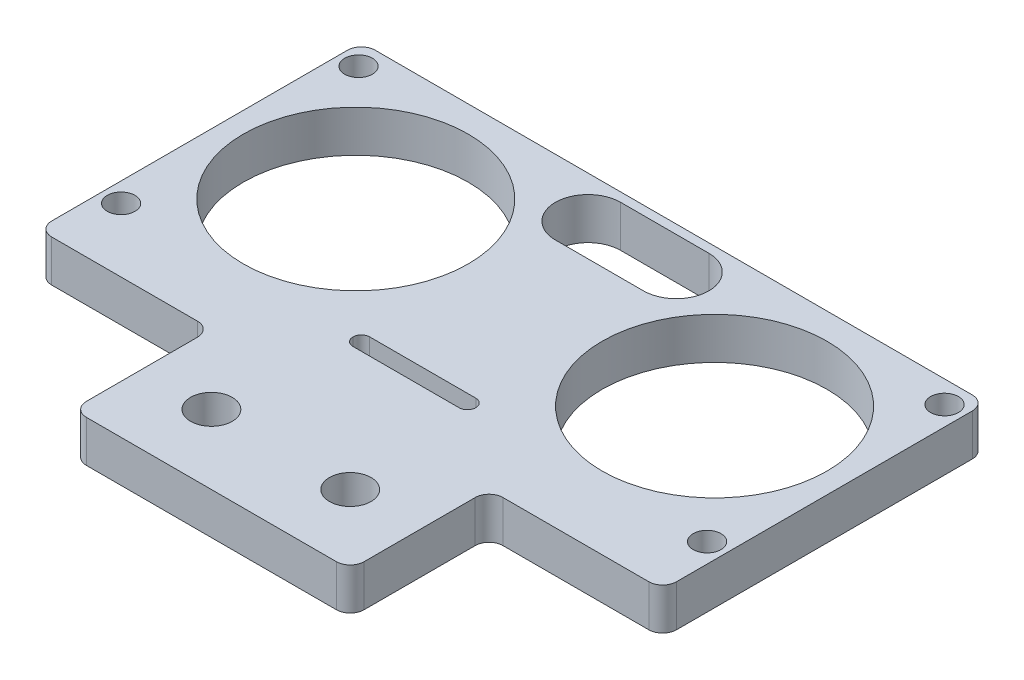
ISO-10303-21;
HEADER;
FILE_DESCRIPTION(('STEP AP214'),'2;1');
FILE_NAME('part.step','',(''),(''),'','','');
FILE_SCHEMA(('AUTOMOTIVE_DESIGN { 1 0 10303 214 1 1 1 1 }'));
ENDSEC;
DATA;
#1=APPLICATION_CONTEXT('core data for automotive mechanical design processes');
#2=APPLICATION_PROTOCOL_DEFINITION('international standard','automotive_design',2000,#1);
#3=PRODUCT_CONTEXT('',#1,'mechanical');
#4=PRODUCT('Part','Part','',(#3));
#5=PRODUCT_RELATED_PRODUCT_CATEGORY('part','',(#4));
#6=PRODUCT_DEFINITION_FORMATION('','',#4);
#7=PRODUCT_DEFINITION_CONTEXT('part definition',#1,'design');
#8=PRODUCT_DEFINITION('design','',#6,#7);
#9=PRODUCT_DEFINITION_SHAPE('','',#8);
#10=(LENGTH_UNIT() NAMED_UNIT(*) SI_UNIT(.MILLI.,.METRE.));
#11=(NAMED_UNIT(*) PLANE_ANGLE_UNIT() SI_UNIT($,.RADIAN.));
#12=(NAMED_UNIT(*) SI_UNIT($,.STERADIAN.) SOLID_ANGLE_UNIT());
#13=UNCERTAINTY_MEASURE_WITH_UNIT(LENGTH_MEASURE(1.E-05),#10,'distance_accuracy_value','');
#14=(GEOMETRIC_REPRESENTATION_CONTEXT(3) GLOBAL_UNCERTAINTY_ASSIGNED_CONTEXT((#13)) GLOBAL_UNIT_ASSIGNED_CONTEXT((#10,
#11,#12)) REPRESENTATION_CONTEXT('',''));
#15=CARTESIAN_POINT('',(0.,0.,0.));
#16=DIRECTION('',(0.,0.,1.));
#17=DIRECTION('',(1.,0.,0.));
#18=AXIS2_PLACEMENT_3D('',#15,#16,#17);
#19=CARTESIAN_POINT('',(0.,3.,0.));
#20=DIRECTION('',(0.,-1.,0.));
#21=DIRECTION('',(0.,0.,-1.));
#22=AXIS2_PLACEMENT_3D('',#19,#20,#21);
#23=PLANE('',#22);
#24=CARTESIAN_POINT('',(18.68,3.,-1.61999999999999));
#25=DIRECTION('',(0.,-1.,0.));
#26=DIRECTION('',(0.,0.,-1.));
#27=AXIS2_PLACEMENT_3D('',#24,#25,#26);
#28=CIRCLE('',#27,0.6);
#29=CARTESIAN_POINT('',(18.68,3.,-1.01999999999999));
#30=VERTEX_POINT('',#29);
#31=CARTESIAN_POINT('',(18.08,3.,-1.61999999999999));
#32=VERTEX_POINT('',#31);
#33=EDGE_CURVE('E59',#30,#32,#28,.T.);
#34=ORIENTED_EDGE('',*,*,#33,.T.);
#35=CARTESIAN_POINT('',(18.68,3.,-1.61999999999999));
#36=DIRECTION('',(0.,-1.,0.));
#37=DIRECTION('',(0.,0.,-1.));
#38=AXIS2_PLACEMENT_3D('',#35,#36,#37);
#39=CIRCLE('',#38,0.6);
#40=CARTESIAN_POINT('',(18.68,3.,-2.21999999999999));
#41=VERTEX_POINT('',#40);
#42=EDGE_CURVE('E45',#32,#41,#39,.T.);
#43=ORIENTED_EDGE('',*,*,#42,.T.);
#44=DIRECTION('',(-1.,0.,0.));
#45=VECTOR('',#44,1.);
#46=CARTESIAN_POINT('',(18.08,3.,-2.21999999999999));
#47=LINE('',#46,#45);
#48=CARTESIAN_POINT('',(26.32,3.,-2.21999999999999));
#49=VERTEX_POINT('',#48);
#50=EDGE_CURVE('E438',#49,#41,#47,.T.);
#51=ORIENTED_EDGE('',*,*,#50,.F.);
#52=CARTESIAN_POINT('',(26.32,3.,-1.61999999999999));
#53=DIRECTION('',(0.,-1.,0.));
#54=DIRECTION('',(0.,0.,-1.));
#55=AXIS2_PLACEMENT_3D('',#52,#53,#54);
#56=CIRCLE('',#55,0.6);
#57=CARTESIAN_POINT('',(26.92,3.,-1.61999999999999));
#58=VERTEX_POINT('',#57);
#59=EDGE_CURVE('E420',#49,#58,#56,.T.);
#60=ORIENTED_EDGE('',*,*,#59,.T.);
#61=CARTESIAN_POINT('',(26.32,3.,-1.61999999999999));
#62=DIRECTION('',(0.,-1.,0.));
#63=DIRECTION('',(0.,0.,-1.));
#64=AXIS2_PLACEMENT_3D('',#61,#62,#63);
#65=CIRCLE('',#64,0.6);
#66=CARTESIAN_POINT('',(26.32,3.,-1.01999999999999));
#67=VERTEX_POINT('',#66);
#68=EDGE_CURVE('E424',#58,#67,#65,.T.);
#69=ORIENTED_EDGE('',*,*,#68,.T.);
#70=DIRECTION('',(1.,0.,0.));
#71=VECTOR('',#70,1.);
#72=CARTESIAN_POINT('',(18.08,3.,-1.01999999999999));
#73=LINE('',#72,#71);
#74=EDGE_CURVE('E433',#30,#67,#73,.T.);
#75=ORIENTED_EDGE('',*,*,#74,.F.);
#76=EDGE_LOOP('',(#34,#43,#51,#60,#69,#75));
#77=FACE_BOUND('',#76,.T.);
#78=CARTESIAN_POINT('',(35.42,3.,-10.32));
#79=DIRECTION('',(0.,1.,0.));
#80=DIRECTION('',(0.,0.,1.));
#81=AXIS2_PLACEMENT_3D('',#78,#79,#80);
#82=CIRCLE('',#81,8.1);
#83=CARTESIAN_POINT('',(35.42,3.,-2.22));
#84=VERTEX_POINT('',#83);
#85=EDGE_CURVE('E255',#84,#84,#82,.T.);
#86=ORIENTED_EDGE('',*,*,#85,.F.);
#87=EDGE_LOOP('',(#86));
#88=FACE_BOUND('',#87,.T.);
#89=CARTESIAN_POINT('',(9.58,3.,-10.32));
#90=DIRECTION('',(0.,1.,0.));
#91=DIRECTION('',(0.,0.,1.));
#92=AXIS2_PLACEMENT_3D('',#89,#90,#91);
#93=CIRCLE('',#92,8.1);
#94=CARTESIAN_POINT('',(9.58,3.,-2.22));
#95=VERTEX_POINT('',#94);
#96=EDGE_CURVE('E261',#95,#95,#93,.T.);
#97=ORIENTED_EDGE('',*,*,#96,.F.);
#98=EDGE_LOOP('',(#97));
#99=FACE_BOUND('',#98,.T.);
#100=CARTESIAN_POINT('',(43.6,3.,-18.7));
#101=DIRECTION('',(0.,1.,0.));
#102=DIRECTION('',(0.,0.,-1.));
#103=AXIS2_PLACEMENT_3D('',#100,#101,#102);
#104=CIRCLE('',#103,0.999999999999998);
#105=CARTESIAN_POINT('',(43.6,3.,-19.7));
#106=VERTEX_POINT('',#105);
#107=EDGE_CURVE('E267',#106,#106,#104,.T.);
#108=ORIENTED_EDGE('',*,*,#107,.F.);
#109=EDGE_LOOP('',(#108));
#110=FACE_BOUND('',#109,.T.);
#111=CARTESIAN_POINT('',(43.6,3.,-1.6));
#112=DIRECTION('',(0.,1.,0.));
#113=DIRECTION('',(0.,0.,1.));
#114=AXIS2_PLACEMENT_3D('',#111,#112,#113);
#115=CIRCLE('',#114,1.00000000000001);
#116=CARTESIAN_POINT('',(43.6,3.,-0.599999999999996));
#117=VERTEX_POINT('',#116);
#118=EDGE_CURVE('E273',#117,#117,#115,.T.);
#119=ORIENTED_EDGE('',*,*,#118,.F.);
#120=EDGE_LOOP('',(#119));
#121=FACE_BOUND('',#120,.T.);
#122=CARTESIAN_POINT('',(1.4,3.,-1.6));
#123=DIRECTION('',(0.,1.,0.));
#124=DIRECTION('',(0.,0.,-1.));
#125=AXIS2_PLACEMENT_3D('',#122,#123,#124);
#126=CIRCLE('',#125,1.);
#127=CARTESIAN_POINT('',(1.4,3.,-2.6));
#128=VERTEX_POINT('',#127);
#129=EDGE_CURVE('E279',#128,#128,#126,.T.);
#130=ORIENTED_EDGE('',*,*,#129,.F.);
#131=EDGE_LOOP('',(#130));
#132=FACE_BOUND('',#131,.T.);
#133=CARTESIAN_POINT('',(1.4,3.,-18.7));
#134=DIRECTION('',(0.,1.,0.));
#135=DIRECTION('',(0.,0.,1.));
#136=AXIS2_PLACEMENT_3D('',#133,#134,#135);
#137=CIRCLE('',#136,1.);
#138=CARTESIAN_POINT('',(1.4,3.,-17.7));
#139=VERTEX_POINT('',#138);
#140=EDGE_CURVE('E285',#139,#139,#137,.T.);
#141=ORIENTED_EDGE('',*,*,#140,.F.);
#142=EDGE_LOOP('',(#141));
#143=FACE_BOUND('',#142,.T.);
#144=DIRECTION('',(0.,0.,1.));
#145=VECTOR('',#144,1.);
#146=CARTESIAN_POINT('',(0.,3.,0.));
#147=LINE('',#146,#145);
#148=CARTESIAN_POINT('',(0.,3.,-19.3));
#149=VERTEX_POINT('',#148);
#150=CARTESIAN_POINT('',(0.,3.,2.00000000000001));
#151=VERTEX_POINT('',#150);
#152=EDGE_CURVE('E291',#149,#151,#147,.T.);
#153=ORIENTED_EDGE('',*,*,#152,.T.);
#154=CARTESIAN_POINT('',(1.,3.,2.00000000000001));
#155=DIRECTION('',(0.,-1.,0.));
#156=DIRECTION('',(0.,0.,-1.));
#157=AXIS2_PLACEMENT_3D('',#154,#155,#156);
#158=CIRCLE('',#157,1.);
#159=CARTESIAN_POINT('',(1.,3.,3.00000000000001));
#160=VERTEX_POINT('',#159);
#161=EDGE_CURVE('E370',#151,#160,#158,.F.);
#162=ORIENTED_EDGE('',*,*,#161,.T.);
#163=DIRECTION('',(1.,0.,0.));
#164=VECTOR('',#163,1.);
#165=CARTESIAN_POINT('',(12.5,3.,3.00000000000001));
#166=LINE('',#165,#164);
#167=CARTESIAN_POINT('',(11.5,3.,3.00000000000001));
#168=VERTEX_POINT('',#167);
#169=EDGE_CURVE('E294',#160,#168,#166,.T.);
#170=ORIENTED_EDGE('',*,*,#169,.T.);
#171=CARTESIAN_POINT('',(11.5,3.,4.00000000000001));
#172=DIRECTION('',(0.,-1.,0.));
#173=DIRECTION('',(0.,0.,-1.));
#174=AXIS2_PLACEMENT_3D('',#171,#172,#173);
#175=CIRCLE('',#174,1.);
#176=CARTESIAN_POINT('',(12.5,3.,4.00000000000001));
#177=VERTEX_POINT('',#176);
#178=EDGE_CURVE('E404',#168,#177,#175,.T.);
#179=ORIENTED_EDGE('',*,*,#178,.T.);
#180=DIRECTION('',(0.,0.,1.));
#181=VECTOR('',#180,1.);
#182=CARTESIAN_POINT('',(12.5,3.,3.00000000000001));
#183=LINE('',#182,#181);
#184=CARTESIAN_POINT('',(12.5,3.,12.));
#185=VERTEX_POINT('',#184);
#186=EDGE_CURVE('E298',#177,#185,#183,.T.);
#187=ORIENTED_EDGE('',*,*,#186,.T.);
#188=CARTESIAN_POINT('',(13.5,3.,12.));
#189=DIRECTION('',(0.,-1.,0.));
#190=DIRECTION('',(0.,0.,-1.));
#191=AXIS2_PLACEMENT_3D('',#188,#189,#190);
#192=CIRCLE('',#191,1.);
#193=CARTESIAN_POINT('',(13.5,3.,13.));
#194=VERTEX_POINT('',#193);
#195=EDGE_CURVE('E366',#185,#194,#192,.F.);
#196=ORIENTED_EDGE('',*,*,#195,.T.);
#197=DIRECTION('',(1.,0.,0.));
#198=VECTOR('',#197,1.);
#199=CARTESIAN_POINT('',(12.5,3.,13.));
#200=LINE('',#199,#198);
#201=CARTESIAN_POINT('',(31.5,3.,13.));
#202=VERTEX_POINT('',#201);
#203=EDGE_CURVE('E301',#194,#202,#200,.T.);
#204=ORIENTED_EDGE('',*,*,#203,.T.);
#205=CARTESIAN_POINT('',(31.5,3.,12.));
#206=DIRECTION('',(0.,-1.,0.));
#207=DIRECTION('',(0.,0.,-1.));
#208=AXIS2_PLACEMENT_3D('',#205,#206,#207);
#209=CIRCLE('',#208,1.);
#210=CARTESIAN_POINT('',(32.5,3.,12.));
#211=VERTEX_POINT('',#210);
#212=EDGE_CURVE('E360',#202,#211,#209,.F.);
#213=ORIENTED_EDGE('',*,*,#212,.T.);
#214=DIRECTION('',(0.,0.,-1.));
#215=VECTOR('',#214,1.);
#216=CARTESIAN_POINT('',(32.5,3.,3.00000000000001));
#217=LINE('',#216,#215);
#218=CARTESIAN_POINT('',(32.5,3.,4.00000000000001));
#219=VERTEX_POINT('',#218);
#220=EDGE_CURVE('E304',#211,#219,#217,.T.);
#221=ORIENTED_EDGE('',*,*,#220,.T.);
#222=CARTESIAN_POINT('',(33.5,3.,4.00000000000001));
#223=DIRECTION('',(0.,-1.,0.));
#224=DIRECTION('',(0.,0.,-1.));
#225=AXIS2_PLACEMENT_3D('',#222,#223,#224);
#226=CIRCLE('',#225,1.);
#227=CARTESIAN_POINT('',(33.5,3.,3.00000000000001));
#228=VERTEX_POINT('',#227);
#229=EDGE_CURVE('E408',#219,#228,#226,.T.);
#230=ORIENTED_EDGE('',*,*,#229,.T.);
#231=DIRECTION('',(1.,0.,0.));
#232=VECTOR('',#231,1.);
#233=CARTESIAN_POINT('',(32.5,3.,3.00000000000001));
#234=LINE('',#233,#232);
#235=CARTESIAN_POINT('',(44.,3.,3.00000000000001));
#236=VERTEX_POINT('',#235);
#237=EDGE_CURVE('E307',#228,#236,#234,.T.);
#238=ORIENTED_EDGE('',*,*,#237,.T.);
#239=CARTESIAN_POINT('',(44.,3.,2.00000000000001));
#240=DIRECTION('',(0.,-1.,0.));
#241=DIRECTION('',(0.,0.,-1.));
#242=AXIS2_PLACEMENT_3D('',#239,#240,#241);
#243=CIRCLE('',#242,1.);
#244=CARTESIAN_POINT('',(45.,3.,2.00000000000001));
#245=VERTEX_POINT('',#244);
#246=EDGE_CURVE('E362',#236,#245,#243,.F.);
#247=ORIENTED_EDGE('',*,*,#246,.T.);
#248=DIRECTION('',(0.,0.,-1.));
#249=VECTOR('',#248,1.);
#250=CARTESIAN_POINT('',(45.,3.,0.));
#251=LINE('',#250,#249);
#252=CARTESIAN_POINT('',(45.,3.,-19.3));
#253=VERTEX_POINT('',#252);
#254=EDGE_CURVE('E310',#245,#253,#251,.T.);
#255=ORIENTED_EDGE('',*,*,#254,.T.);
#256=CARTESIAN_POINT('',(44.,3.,-19.3));
#257=DIRECTION('',(0.,-1.,0.));
#258=DIRECTION('',(0.,0.,-1.));
#259=AXIS2_PLACEMENT_3D('',#256,#257,#258);
#260=CIRCLE('',#259,1.);
#261=CARTESIAN_POINT('',(44.,3.,-20.3));
#262=VERTEX_POINT('',#261);
#263=EDGE_CURVE('E364',#253,#262,#260,.F.);
#264=ORIENTED_EDGE('',*,*,#263,.T.);
#265=DIRECTION('',(-1.,0.,0.));
#266=VECTOR('',#265,1.);
#267=CARTESIAN_POINT('',(0.,3.,-20.3));
#268=LINE('',#267,#266);
#269=CARTESIAN_POINT('',(1.,3.,-20.3));
#270=VERTEX_POINT('',#269);
#271=EDGE_CURVE('E313',#262,#270,#268,.T.);
#272=ORIENTED_EDGE('',*,*,#271,.T.);
#273=CARTESIAN_POINT('',(1.,3.,-19.3));
#274=DIRECTION('',(0.,-1.,0.));
#275=DIRECTION('',(0.,0.,-1.));
#276=AXIS2_PLACEMENT_3D('',#273,#274,#275);
#277=CIRCLE('',#276,1.);
#278=EDGE_CURVE('E368',#270,#149,#277,.F.);
#279=ORIENTED_EDGE('',*,*,#278,.T.);
#280=EDGE_LOOP('',(#153,#162,#170,#179,#187,#196,#204,#213,#221,#230,#238,#247,#255,#264,#272,#279));
#281=FACE_BOUND('',#280,.T.);
#282=CARTESIAN_POINT('',(19.325,3.,-17.3));
#283=DIRECTION('',(0.,1.,0.));
#284=DIRECTION('',(0.,0.,1.));
#285=AXIS2_PLACEMENT_3D('',#282,#283,#284);
#286=CIRCLE('',#285,2.35);
#287=CARTESIAN_POINT('',(19.325,3.,-19.65));
#288=VERTEX_POINT('',#287);
#289=CARTESIAN_POINT('',(19.325,3.,-14.95));
#290=VERTEX_POINT('',#289);
#291=EDGE_CURVE('E211',#288,#290,#286,.T.);
#292=ORIENTED_EDGE('',*,*,#291,.F.);
#293=DIRECTION('',(-1.,0.,0.));
#294=VECTOR('',#293,1.);
#295=CARTESIAN_POINT('',(25.675,3.,-19.65));
#296=LINE('',#295,#294);
#297=CARTESIAN_POINT('',(25.675,3.,-19.65));
#298=VERTEX_POINT('',#297);
#299=EDGE_CURVE('E237',#298,#288,#296,.T.);
#300=ORIENTED_EDGE('',*,*,#299,.F.);
#301=CARTESIAN_POINT('',(25.675,3.,-17.3));
#302=DIRECTION('',(0.,1.,0.));
#303=DIRECTION('',(0.,0.,-1.));
#304=AXIS2_PLACEMENT_3D('',#301,#302,#303);
#305=CIRCLE('',#304,2.35);
#306=CARTESIAN_POINT('',(25.675,3.,-14.95));
#307=VERTEX_POINT('',#306);
#308=EDGE_CURVE('E235',#307,#298,#305,.T.);
#309=ORIENTED_EDGE('',*,*,#308,.F.);
#310=DIRECTION('',(1.,0.,0.));
#311=VECTOR('',#310,1.);
#312=CARTESIAN_POINT('',(25.675,3.,-14.95));
#313=LINE('',#312,#311);
#314=EDGE_CURVE('E221',#290,#307,#313,.T.);
#315=ORIENTED_EDGE('',*,*,#314,.F.);
#316=EDGE_LOOP('',(#292,#300,#309,#315));
#317=FACE_BOUND('',#316,.T.);
#318=CARTESIAN_POINT('',(17.5,3.,8.00000000000001));
#319=DIRECTION('',(0.,1.,0.));
#320=DIRECTION('',(0.,0.,1.));
#321=AXIS2_PLACEMENT_3D('',#318,#319,#320);
#322=CIRCLE('',#321,1.5);
#323=CARTESIAN_POINT('',(17.5,3.,9.50000000000001));
#324=VERTEX_POINT('',#323);
#325=EDGE_CURVE('E244',#324,#324,#322,.T.);
#326=ORIENTED_EDGE('',*,*,#325,.F.);
#327=EDGE_LOOP('',(#326));
#328=FACE_BOUND('',#327,.T.);
#329=CARTESIAN_POINT('',(27.5,3.,8.00000000000001));
#330=DIRECTION('',(0.,1.,0.));
#331=DIRECTION('',(0.,0.,1.));
#332=AXIS2_PLACEMENT_3D('',#329,#330,#331);
#333=CIRCLE('',#332,1.5);
#334=CARTESIAN_POINT('',(27.5,3.,9.50000000000001));
#335=VERTEX_POINT('',#334);
#336=EDGE_CURVE('E461',#335,#335,#333,.T.);
#337=ORIENTED_EDGE('',*,*,#336,.F.);
#338=EDGE_LOOP('',(#337));
#339=FACE_BOUND('',#338,.T.);
#340=ADVANCED_FACE('F36',(#77,#88,#99,#110,#121,#132,#143,#281,#317,#328,#339),#23,.F.);
#341=CARTESIAN_POINT('',(0.,0.,0.));
#342=DIRECTION('',(0.,-1.,0.));
#343=DIRECTION('',(0.,0.,-1.));
#344=AXIS2_PLACEMENT_3D('',#341,#342,#343);
#345=PLANE('',#344);
#346=DIRECTION('',(-1.,0.,0.));
#347=VECTOR('',#346,1.);
#348=CARTESIAN_POINT('',(18.08,0.,-2.21999999999999));
#349=LINE('',#348,#347);
#350=CARTESIAN_POINT('',(26.32,0.,-2.21999999999999));
#351=VERTEX_POINT('',#350);
#352=CARTESIAN_POINT('',(18.68,0.,-2.21999999999999));
#353=VERTEX_POINT('',#352);
#354=EDGE_CURVE('E457',#351,#353,#349,.T.);
#355=ORIENTED_EDGE('',*,*,#354,.T.);
#356=CARTESIAN_POINT('',(18.68,0.,-1.61999999999999));
#357=DIRECTION('',(0.,-1.,0.));
#358=DIRECTION('',(0.,0.,-1.));
#359=AXIS2_PLACEMENT_3D('',#356,#357,#358);
#360=CIRCLE('',#359,0.6);
#361=CARTESIAN_POINT('',(18.08,0.,-1.61999999999999));
#362=VERTEX_POINT('',#361);
#363=EDGE_CURVE('E11',#353,#362,#360,.F.);
#364=ORIENTED_EDGE('',*,*,#363,.T.);
#365=CARTESIAN_POINT('',(18.68,0.,-1.61999999999999));
#366=DIRECTION('',(0.,-1.,0.));
#367=DIRECTION('',(0.,0.,-1.));
#368=AXIS2_PLACEMENT_3D('',#365,#366,#367);
#369=CIRCLE('',#368,0.6);
#370=CARTESIAN_POINT('',(18.68,0.,-1.01999999999999));
#371=VERTEX_POINT('',#370);
#372=EDGE_CURVE('E429',#362,#371,#369,.F.);
#373=ORIENTED_EDGE('',*,*,#372,.T.);
#374=DIRECTION('',(1.,0.,0.));
#375=VECTOR('',#374,1.);
#376=CARTESIAN_POINT('',(18.08,0.,-1.01999999999999));
#377=LINE('',#376,#375);
#378=CARTESIAN_POINT('',(26.32,0.,-1.01999999999999));
#379=VERTEX_POINT('',#378);
#380=EDGE_CURVE('E454',#371,#379,#377,.T.);
#381=ORIENTED_EDGE('',*,*,#380,.T.);
#382=CARTESIAN_POINT('',(26.32,0.,-1.61999999999999));
#383=DIRECTION('',(0.,-1.,0.));
#384=DIRECTION('',(0.,0.,-1.));
#385=AXIS2_PLACEMENT_3D('',#382,#383,#384);
#386=CIRCLE('',#385,0.6);
#387=CARTESIAN_POINT('',(26.92,0.,-1.61999999999999));
#388=VERTEX_POINT('',#387);
#389=EDGE_CURVE('E426',#379,#388,#386,.F.);
#390=ORIENTED_EDGE('',*,*,#389,.T.);
#391=CARTESIAN_POINT('',(26.32,0.,-1.61999999999999));
#392=DIRECTION('',(0.,-1.,0.));
#393=DIRECTION('',(0.,0.,-1.));
#394=AXIS2_PLACEMENT_3D('',#391,#392,#393);
#395=CIRCLE('',#394,0.6);
#396=EDGE_CURVE('E422',#388,#351,#395,.F.);
#397=ORIENTED_EDGE('',*,*,#396,.T.);
#398=EDGE_LOOP('',(#355,#364,#373,#381,#390,#397));
#399=FACE_BOUND('',#398,.T.);
#400=CARTESIAN_POINT('',(17.5,0.,8.00000000000001));
#401=DIRECTION('',(0.,1.,0.));
#402=DIRECTION('',(0.,0.,1.));
#403=AXIS2_PLACEMENT_3D('',#400,#401,#402);
#404=CIRCLE('',#403,1.5);
#405=CARTESIAN_POINT('',(17.5,0.,9.50000000000001));
#406=VERTEX_POINT('',#405);
#407=EDGE_CURVE('E464',#406,#406,#404,.T.);
#408=ORIENTED_EDGE('',*,*,#407,.T.);
#409=EDGE_LOOP('',(#408));
#410=FACE_BOUND('',#409,.T.);
#411=CARTESIAN_POINT('',(9.58,0.,-10.32));
#412=DIRECTION('',(0.,1.,0.));
#413=DIRECTION('',(0.,0.,1.));
#414=AXIS2_PLACEMENT_3D('',#411,#412,#413);
#415=CIRCLE('',#414,8.1);
#416=CARTESIAN_POINT('',(9.58,0.,-2.22));
#417=VERTEX_POINT('',#416);
#418=EDGE_CURVE('E258',#417,#417,#415,.T.);
#419=ORIENTED_EDGE('',*,*,#418,.T.);
#420=EDGE_LOOP('',(#419));
#421=FACE_BOUND('',#420,.T.);
#422=CARTESIAN_POINT('',(43.6,0.,-1.6));
#423=DIRECTION('',(0.,1.,0.));
#424=DIRECTION('',(0.,0.,1.));
#425=AXIS2_PLACEMENT_3D('',#422,#423,#424);
#426=CIRCLE('',#425,1.00000000000001);
#427=CARTESIAN_POINT('',(43.6,0.,-0.599999999999996));
#428=VERTEX_POINT('',#427);
#429=EDGE_CURVE('E270',#428,#428,#426,.T.);
#430=ORIENTED_EDGE('',*,*,#429,.T.);
#431=EDGE_LOOP('',(#430));
#432=FACE_BOUND('',#431,.T.);
#433=CARTESIAN_POINT('',(1.4,0.,-18.7));
#434=DIRECTION('',(0.,1.,0.));
#435=DIRECTION('',(0.,0.,1.));
#436=AXIS2_PLACEMENT_3D('',#433,#434,#435);
#437=CIRCLE('',#436,1.);
#438=CARTESIAN_POINT('',(1.4,0.,-17.7));
#439=VERTEX_POINT('',#438);
#440=EDGE_CURVE('E282',#439,#439,#437,.T.);
#441=ORIENTED_EDGE('',*,*,#440,.T.);
#442=EDGE_LOOP('',(#441));
#443=FACE_BOUND('',#442,.T.);
#444=DIRECTION('',(1.,0.,0.));
#445=VECTOR('',#444,1.);
#446=CARTESIAN_POINT('',(12.5,0.,3.00000000000001));
#447=LINE('',#446,#445);
#448=CARTESIAN_POINT('',(1.,0.,3.00000000000001));
#449=VERTEX_POINT('',#448);
#450=CARTESIAN_POINT('',(11.5,0.,3.00000000000001));
#451=VERTEX_POINT('',#450);
#452=EDGE_CURVE('E288',#449,#451,#447,.T.);
#453=ORIENTED_EDGE('',*,*,#452,.F.);
#454=CARTESIAN_POINT('',(1.,0.,2.00000000000001));
#455=DIRECTION('',(0.,-1.,0.));
#456=DIRECTION('',(0.,0.,-1.));
#457=AXIS2_PLACEMENT_3D('',#454,#455,#456);
#458=CIRCLE('',#457,1.);
#459=CARTESIAN_POINT('',(0.,0.,2.00000000000001));
#460=VERTEX_POINT('',#459);
#461=EDGE_CURVE('E353',#449,#460,#458,.T.);
#462=ORIENTED_EDGE('',*,*,#461,.T.);
#463=DIRECTION('',(0.,0.,1.));
#464=VECTOR('',#463,1.);
#465=CARTESIAN_POINT('',(0.,0.,0.));
#466=LINE('',#465,#464);
#467=CARTESIAN_POINT('',(0.,0.,-19.3));
#468=VERTEX_POINT('',#467);
#469=EDGE_CURVE('E295',#468,#460,#466,.T.);
#470=ORIENTED_EDGE('',*,*,#469,.F.);
#471=CARTESIAN_POINT('',(1.,0.,-19.3));
#472=DIRECTION('',(0.,-1.,0.));
#473=DIRECTION('',(0.,0.,-1.));
#474=AXIS2_PLACEMENT_3D('',#471,#472,#473);
#475=CIRCLE('',#474,1.);
#476=CARTESIAN_POINT('',(1.,0.,-20.3));
#477=VERTEX_POINT('',#476);
#478=EDGE_CURVE('E351',#468,#477,#475,.T.);
#479=ORIENTED_EDGE('',*,*,#478,.T.);
#480=DIRECTION('',(-1.,0.,0.));
#481=VECTOR('',#480,1.);
#482=CARTESIAN_POINT('',(0.,0.,-20.3));
#483=LINE('',#482,#481);
#484=CARTESIAN_POINT('',(44.,0.,-20.3));
#485=VERTEX_POINT('',#484);
#486=EDGE_CURVE('E334',#485,#477,#483,.T.);
#487=ORIENTED_EDGE('',*,*,#486,.F.);
#488=CARTESIAN_POINT('',(44.,0.,-19.3));
#489=DIRECTION('',(0.,-1.,0.));
#490=DIRECTION('',(0.,0.,-1.));
#491=AXIS2_PLACEMENT_3D('',#488,#489,#490);
#492=CIRCLE('',#491,1.);
#493=CARTESIAN_POINT('',(45.,0.,-19.3));
#494=VERTEX_POINT('',#493);
#495=EDGE_CURVE('E347',#485,#494,#492,.T.);
#496=ORIENTED_EDGE('',*,*,#495,.T.);
#497=DIRECTION('',(0.,0.,-1.));
#498=VECTOR('',#497,1.);
#499=CARTESIAN_POINT('',(45.,0.,0.));
#500=LINE('',#499,#498);
#501=CARTESIAN_POINT('',(45.,0.,2.00000000000001));
#502=VERTEX_POINT('',#501);
#503=EDGE_CURVE('E331',#502,#494,#500,.T.);
#504=ORIENTED_EDGE('',*,*,#503,.F.);
#505=CARTESIAN_POINT('',(44.,0.,2.00000000000001));
#506=DIRECTION('',(0.,-1.,0.));
#507=DIRECTION('',(0.,0.,-1.));
#508=AXIS2_PLACEMENT_3D('',#505,#506,#507);
#509=CIRCLE('',#508,1.);
#510=CARTESIAN_POINT('',(44.,0.,3.00000000000001));
#511=VERTEX_POINT('',#510);
#512=EDGE_CURVE('E345',#502,#511,#509,.T.);
#513=ORIENTED_EDGE('',*,*,#512,.T.);
#514=DIRECTION('',(1.,0.,0.));
#515=VECTOR('',#514,1.);
#516=CARTESIAN_POINT('',(32.5,0.,3.00000000000001));
#517=LINE('',#516,#515);
#518=CARTESIAN_POINT('',(33.5,0.,3.00000000000001));
#519=VERTEX_POINT('',#518);
#520=EDGE_CURVE('E328',#519,#511,#517,.T.);
#521=ORIENTED_EDGE('',*,*,#520,.F.);
#522=CARTESIAN_POINT('',(33.5,0.,4.00000000000001));
#523=DIRECTION('',(0.,-1.,0.));
#524=DIRECTION('',(0.,0.,-1.));
#525=AXIS2_PLACEMENT_3D('',#522,#523,#524);
#526=CIRCLE('',#525,1.);
#527=CARTESIAN_POINT('',(32.5,0.,4.00000000000001));
#528=VERTEX_POINT('',#527);
#529=EDGE_CURVE('E406',#519,#528,#526,.F.);
#530=ORIENTED_EDGE('',*,*,#529,.T.);
#531=DIRECTION('',(0.,0.,-1.));
#532=VECTOR('',#531,1.);
#533=CARTESIAN_POINT('',(32.5,0.,3.00000000000001));
#534=LINE('',#533,#532);
#535=CARTESIAN_POINT('',(32.5,0.,12.));
#536=VERTEX_POINT('',#535);
#537=EDGE_CURVE('E325',#536,#528,#534,.T.);
#538=ORIENTED_EDGE('',*,*,#537,.F.);
#539=CARTESIAN_POINT('',(31.5,0.,12.));
#540=DIRECTION('',(0.,-1.,0.));
#541=DIRECTION('',(0.,0.,-1.));
#542=AXIS2_PLACEMENT_3D('',#539,#540,#541);
#543=CIRCLE('',#542,1.);
#544=CARTESIAN_POINT('',(31.5,0.,13.));
#545=VERTEX_POINT('',#544);
#546=EDGE_CURVE('E343',#536,#545,#543,.T.);
#547=ORIENTED_EDGE('',*,*,#546,.T.);
#548=DIRECTION('',(1.,0.,0.));
#549=VECTOR('',#548,1.);
#550=CARTESIAN_POINT('',(12.5,0.,13.));
#551=LINE('',#550,#549);
#552=CARTESIAN_POINT('',(13.5,0.,13.));
#553=VERTEX_POINT('',#552);
#554=EDGE_CURVE('E322',#553,#545,#551,.T.);
#555=ORIENTED_EDGE('',*,*,#554,.F.);
#556=CARTESIAN_POINT('',(13.5,0.,12.));
#557=DIRECTION('',(0.,-1.,0.));
#558=DIRECTION('',(0.,0.,-1.));
#559=AXIS2_PLACEMENT_3D('',#556,#557,#558);
#560=CIRCLE('',#559,1.);
#561=CARTESIAN_POINT('',(12.5,0.,12.));
#562=VERTEX_POINT('',#561);
#563=EDGE_CURVE('E349',#553,#562,#560,.T.);
#564=ORIENTED_EDGE('',*,*,#563,.T.);
#565=DIRECTION('',(0.,0.,1.));
#566=VECTOR('',#565,1.);
#567=CARTESIAN_POINT('',(12.5,0.,3.00000000000001));
#568=LINE('',#567,#566);
#569=CARTESIAN_POINT('',(12.5,0.,4.00000000000001));
#570=VERTEX_POINT('',#569);
#571=EDGE_CURVE('E319',#570,#562,#568,.T.);
#572=ORIENTED_EDGE('',*,*,#571,.F.);
#573=CARTESIAN_POINT('',(11.5,0.,4.00000000000001));
#574=DIRECTION('',(0.,-1.,0.));
#575=DIRECTION('',(0.,0.,-1.));
#576=AXIS2_PLACEMENT_3D('',#573,#574,#575);
#577=CIRCLE('',#576,1.);
#578=EDGE_CURVE('E402',#570,#451,#577,.F.);
#579=ORIENTED_EDGE('',*,*,#578,.T.);
#580=EDGE_LOOP('',(#453,#462,#470,#479,#487,#496,#504,#513,#521,#530,#538,#547,#555,#564,#572,#579));
#581=FACE_BOUND('',#580,.T.);
#582=CARTESIAN_POINT('',(1.4,0.,-1.6));
#583=DIRECTION('',(0.,1.,0.));
#584=DIRECTION('',(0.,0.,-1.));
#585=AXIS2_PLACEMENT_3D('',#582,#583,#584);
#586=CIRCLE('',#585,1.);
#587=CARTESIAN_POINT('',(1.4,0.,-2.6));
#588=VERTEX_POINT('',#587);
#589=EDGE_CURVE('E276',#588,#588,#586,.T.);
#590=ORIENTED_EDGE('',*,*,#589,.T.);
#591=EDGE_LOOP('',(#590));
#592=FACE_BOUND('',#591,.T.);
#593=CARTESIAN_POINT('',(43.6,0.,-18.7));
#594=DIRECTION('',(0.,1.,0.));
#595=DIRECTION('',(0.,0.,-1.));
#596=AXIS2_PLACEMENT_3D('',#593,#594,#595);
#597=CIRCLE('',#596,0.999999999999998);
#598=CARTESIAN_POINT('',(43.6,0.,-19.7));
#599=VERTEX_POINT('',#598);
#600=EDGE_CURVE('E264',#599,#599,#597,.T.);
#601=ORIENTED_EDGE('',*,*,#600,.T.);
#602=EDGE_LOOP('',(#601));
#603=FACE_BOUND('',#602,.T.);
#604=CARTESIAN_POINT('',(35.42,0.,-10.32));
#605=DIRECTION('',(0.,1.,0.));
#606=DIRECTION('',(0.,0.,1.));
#607=AXIS2_PLACEMENT_3D('',#604,#605,#606);
#608=CIRCLE('',#607,8.1);
#609=CARTESIAN_POINT('',(35.42,0.,-2.22));
#610=VERTEX_POINT('',#609);
#611=EDGE_CURVE('E229',#610,#610,#608,.T.);
#612=ORIENTED_EDGE('',*,*,#611,.T.);
#613=EDGE_LOOP('',(#612));
#614=FACE_BOUND('',#613,.T.);
#615=DIRECTION('',(-1.,0.,0.));
#616=VECTOR('',#615,1.);
#617=CARTESIAN_POINT('',(25.675,0.,-19.65));
#618=LINE('',#617,#616);
#619=CARTESIAN_POINT('',(25.675,0.,-19.65));
#620=VERTEX_POINT('',#619);
#621=CARTESIAN_POINT('',(19.325,0.,-19.65));
#622=VERTEX_POINT('',#621);
#623=EDGE_CURVE('E222',#620,#622,#618,.T.);
#624=ORIENTED_EDGE('',*,*,#623,.T.);
#625=CARTESIAN_POINT('',(19.325,0.,-17.3));
#626=DIRECTION('',(0.,1.,0.));
#627=DIRECTION('',(0.,0.,1.));
#628=AXIS2_PLACEMENT_3D('',#625,#626,#627);
#629=CIRCLE('',#628,2.35);
#630=CARTESIAN_POINT('',(19.325,0.,-14.95));
#631=VERTEX_POINT('',#630);
#632=EDGE_CURVE('E242',#622,#631,#629,.T.);
#633=ORIENTED_EDGE('',*,*,#632,.T.);
#634=DIRECTION('',(1.,0.,0.));
#635=VECTOR('',#634,1.);
#636=CARTESIAN_POINT('',(25.675,0.,-14.95));
#637=LINE('',#636,#635);
#638=CARTESIAN_POINT('',(25.675,0.,-14.95));
#639=VERTEX_POINT('',#638);
#640=EDGE_CURVE('E228',#631,#639,#637,.T.);
#641=ORIENTED_EDGE('',*,*,#640,.T.);
#642=CARTESIAN_POINT('',(25.675,0.,-17.3));
#643=DIRECTION('',(0.,1.,0.));
#644=DIRECTION('',(0.,0.,-1.));
#645=AXIS2_PLACEMENT_3D('',#642,#643,#644);
#646=CIRCLE('',#645,2.35);
#647=EDGE_CURVE('E246',#639,#620,#646,.T.);
#648=ORIENTED_EDGE('',*,*,#647,.T.);
#649=EDGE_LOOP('',(#624,#633,#641,#648));
#650=FACE_BOUND('',#649,.T.);
#651=CARTESIAN_POINT('',(27.5,0.,8.00000000000001));
#652=DIRECTION('',(0.,1.,0.));
#653=DIRECTION('',(0.,0.,1.));
#654=AXIS2_PLACEMENT_3D('',#651,#652,#653);
#655=CIRCLE('',#654,1.5);
#656=CARTESIAN_POINT('',(27.5,0.,9.50000000000001));
#657=VERTEX_POINT('',#656);
#658=EDGE_CURVE('E465',#657,#657,#655,.T.);
#659=ORIENTED_EDGE('',*,*,#658,.T.);
#660=EDGE_LOOP('',(#659));
#661=FACE_BOUND('',#660,.T.);
#662=ADVANCED_FACE('F472',(#399,#410,#421,#432,#443,#581,#592,#603,#614,#650,#661),#345,.T.);
#663=CARTESIAN_POINT('',(12.5,3.,3.00000000000001));
#664=DIRECTION('',(0.,0.,-1.));
#665=DIRECTION('',(-1.,0.,0.));
#666=AXIS2_PLACEMENT_3D('',#663,#664,#665);
#667=PLANE('',#666);
#668=ORIENTED_EDGE('',*,*,#169,.F.);
#669=DIRECTION('',(0.,-1.,0.));
#670=VECTOR('',#669,1.);
#671=CARTESIAN_POINT('',(1.,3.,3.00000000000001));
#672=LINE('',#671,#670);
#673=EDGE_CURVE('E340',#160,#449,#672,.T.);
#674=ORIENTED_EDGE('',*,*,#673,.T.);
#675=ORIENTED_EDGE('',*,*,#452,.T.);
#676=DIRECTION('',(0.,-1.,0.));
#677=VECTOR('',#676,1.);
#678=CARTESIAN_POINT('',(11.5,3.,3.00000000000001));
#679=LINE('',#678,#677);
#680=EDGE_CURVE('E316',#451,#168,#679,.F.);
#681=ORIENTED_EDGE('',*,*,#680,.T.);
#682=EDGE_LOOP('',(#668,#674,#675,#681));
#683=FACE_BOUND('',#682,.T.);
#684=ADVANCED_FACE('F495',(#683),#667,.F.);
#685=CARTESIAN_POINT('',(12.5,3.,3.00000000000001));
#686=DIRECTION('',(1.,0.,0.));
#687=DIRECTION('',(0.,0.,-1.));
#688=AXIS2_PLACEMENT_3D('',#685,#686,#687);
#689=PLANE('',#688);
#690=ORIENTED_EDGE('',*,*,#186,.F.);
#691=DIRECTION('',(0.,-1.,0.));
#692=VECTOR('',#691,1.);
#693=CARTESIAN_POINT('',(12.5,0.,4.00000000000001));
#694=LINE('',#693,#692);
#695=EDGE_CURVE('E379',#177,#570,#694,.T.);
#696=ORIENTED_EDGE('',*,*,#695,.T.);
#697=ORIENTED_EDGE('',*,*,#571,.T.);
#698=DIRECTION('',(0.,-1.,0.));
#699=VECTOR('',#698,1.);
#700=CARTESIAN_POINT('',(12.5,3.,12.));
#701=LINE('',#700,#699);
#702=EDGE_CURVE('E377',#562,#185,#701,.F.);
#703=ORIENTED_EDGE('',*,*,#702,.T.);
#704=EDGE_LOOP('',(#690,#696,#697,#703));
#705=FACE_BOUND('',#704,.T.);
#706=ADVANCED_FACE('F524',(#705),#689,.F.);
#707=CARTESIAN_POINT('',(12.5,3.,13.));
#708=DIRECTION('',(0.,0.,-1.));
#709=DIRECTION('',(-1.,0.,0.));
#710=AXIS2_PLACEMENT_3D('',#707,#708,#709);
#711=PLANE('',#710);
#712=ORIENTED_EDGE('',*,*,#203,.F.);
#713=DIRECTION('',(0.,-1.,0.));
#714=VECTOR('',#713,1.);
#715=CARTESIAN_POINT('',(13.5,3.,13.));
#716=LINE('',#715,#714);
#717=EDGE_CURVE('E384',#194,#553,#716,.T.);
#718=ORIENTED_EDGE('',*,*,#717,.T.);
#719=ORIENTED_EDGE('',*,*,#554,.T.);
#720=DIRECTION('',(0.,-1.,0.));
#721=VECTOR('',#720,1.);
#722=CARTESIAN_POINT('',(31.5,3.,13.));
#723=LINE('',#722,#721);
#724=EDGE_CURVE('E382',#545,#202,#723,.F.);
#725=ORIENTED_EDGE('',*,*,#724,.T.);
#726=EDGE_LOOP('',(#712,#718,#719,#725));
#727=FACE_BOUND('',#726,.T.);
#728=ADVANCED_FACE('F520',(#727),#711,.F.);
#729=CARTESIAN_POINT('',(32.5,3.,3.00000000000001));
#730=DIRECTION('',(-1.,0.,0.));
#731=DIRECTION('',(0.,0.,1.));
#732=AXIS2_PLACEMENT_3D('',#729,#730,#731);
#733=PLANE('',#732);
#734=ORIENTED_EDGE('',*,*,#537,.T.);
#735=DIRECTION('',(0.,-1.,0.));
#736=VECTOR('',#735,1.);
#737=CARTESIAN_POINT('',(32.5,3.,4.00000000000001));
#738=LINE('',#737,#736);
#739=EDGE_CURVE('E400',#528,#219,#738,.F.);
#740=ORIENTED_EDGE('',*,*,#739,.T.);
#741=ORIENTED_EDGE('',*,*,#220,.F.);
#742=DIRECTION('',(0.,-1.,0.));
#743=VECTOR('',#742,1.);
#744=CARTESIAN_POINT('',(32.5,3.,12.));
#745=LINE('',#744,#743);
#746=EDGE_CURVE('E397',#211,#536,#745,.T.);
#747=ORIENTED_EDGE('',*,*,#746,.T.);
#748=EDGE_LOOP('',(#734,#740,#741,#747));
#749=FACE_BOUND('',#748,.T.);
#750=ADVANCED_FACE('F516',(#749),#733,.F.);
#751=CARTESIAN_POINT('',(32.5,3.,3.00000000000001));
#752=DIRECTION('',(0.,0.,-1.));
#753=DIRECTION('',(-1.,0.,0.));
#754=AXIS2_PLACEMENT_3D('',#751,#752,#753);
#755=PLANE('',#754);
#756=ORIENTED_EDGE('',*,*,#520,.T.);
#757=DIRECTION('',(0.,-1.,0.));
#758=VECTOR('',#757,1.);
#759=CARTESIAN_POINT('',(44.,3.,3.00000000000001));
#760=LINE('',#759,#758);
#761=EDGE_CURVE('E395',#511,#236,#760,.F.);
#762=ORIENTED_EDGE('',*,*,#761,.T.);
#763=ORIENTED_EDGE('',*,*,#237,.F.);
#764=DIRECTION('',(0.,-1.,0.));
#765=VECTOR('',#764,1.);
#766=CARTESIAN_POINT('',(33.5,0.,3.00000000000001));
#767=LINE('',#766,#765);
#768=EDGE_CURVE('E392',#228,#519,#767,.T.);
#769=ORIENTED_EDGE('',*,*,#768,.T.);
#770=EDGE_LOOP('',(#756,#762,#763,#769));
#771=FACE_BOUND('',#770,.T.);
#772=ADVANCED_FACE('F512',(#771),#755,.F.);
#773=CARTESIAN_POINT('',(45.,3.,0.));
#774=DIRECTION('',(-1.,0.,0.));
#775=DIRECTION('',(0.,0.,1.));
#776=AXIS2_PLACEMENT_3D('',#773,#774,#775);
#777=PLANE('',#776);
#778=ORIENTED_EDGE('',*,*,#503,.T.);
#779=DIRECTION('',(0.,-1.,0.));
#780=VECTOR('',#779,1.);
#781=CARTESIAN_POINT('',(45.,3.,-19.3));
#782=LINE('',#781,#780);
#783=EDGE_CURVE('E390',#494,#253,#782,.F.);
#784=ORIENTED_EDGE('',*,*,#783,.T.);
#785=ORIENTED_EDGE('',*,*,#254,.F.);
#786=DIRECTION('',(0.,-1.,0.));
#787=VECTOR('',#786,1.);
#788=CARTESIAN_POINT('',(45.,3.,2.00000000000001));
#789=LINE('',#788,#787);
#790=EDGE_CURVE('E387',#245,#502,#789,.T.);
#791=ORIENTED_EDGE('',*,*,#790,.T.);
#792=EDGE_LOOP('',(#778,#784,#785,#791));
#793=FACE_BOUND('',#792,.T.);
#794=ADVANCED_FACE('F508',(#793),#777,.F.);
#795=CARTESIAN_POINT('',(0.,3.,-20.3));
#796=DIRECTION('',(0.,0.,1.));
#797=DIRECTION('',(1.,0.,0.));
#798=AXIS2_PLACEMENT_3D('',#795,#796,#797);
#799=PLANE('',#798);
#800=ORIENTED_EDGE('',*,*,#486,.T.);
#801=DIRECTION('',(0.,-1.,0.));
#802=VECTOR('',#801,1.);
#803=CARTESIAN_POINT('',(1.,3.,-20.3));
#804=LINE('',#803,#802);
#805=EDGE_CURVE('E375',#477,#270,#804,.F.);
#806=ORIENTED_EDGE('',*,*,#805,.T.);
#807=ORIENTED_EDGE('',*,*,#271,.F.);
#808=DIRECTION('',(0.,-1.,0.));
#809=VECTOR('',#808,1.);
#810=CARTESIAN_POINT('',(44.,3.,-20.3));
#811=LINE('',#810,#809);
#812=EDGE_CURVE('E372',#262,#485,#811,.T.);
#813=ORIENTED_EDGE('',*,*,#812,.T.);
#814=EDGE_LOOP('',(#800,#806,#807,#813));
#815=FACE_BOUND('',#814,.T.);
#816=ADVANCED_FACE('F504',(#815),#799,.F.);
#817=CARTESIAN_POINT('',(0.,3.,0.));
#818=DIRECTION('',(1.,0.,0.));
#819=DIRECTION('',(0.,0.,-1.));
#820=AXIS2_PLACEMENT_3D('',#817,#818,#819);
#821=PLANE('',#820);
#822=ORIENTED_EDGE('',*,*,#469,.T.);
#823=DIRECTION('',(0.,-1.,0.));
#824=VECTOR('',#823,1.);
#825=CARTESIAN_POINT('',(0.,3.,2.00000000000001));
#826=LINE('',#825,#824);
#827=EDGE_CURVE('E358',#460,#151,#826,.F.);
#828=ORIENTED_EDGE('',*,*,#827,.T.);
#829=ORIENTED_EDGE('',*,*,#152,.F.);
#830=DIRECTION('',(0.,-1.,0.));
#831=VECTOR('',#830,1.);
#832=CARTESIAN_POINT('',(0.,3.,-19.3));
#833=LINE('',#832,#831);
#834=EDGE_CURVE('E355',#149,#468,#833,.T.);
#835=ORIENTED_EDGE('',*,*,#834,.T.);
#836=EDGE_LOOP('',(#822,#828,#829,#835));
#837=FACE_BOUND('',#836,.T.);
#838=ADVANCED_FACE('F501',(#837),#821,.F.);
#839=CARTESIAN_POINT('',(1.4,3.,-18.7));
#840=DIRECTION('',(0.,-1.,0.));
#841=DIRECTION('',(0.,0.,-1.));
#842=AXIS2_PLACEMENT_3D('',#839,#840,#841);
#843=CYLINDRICAL_SURFACE('',#842,1.);
#844=ORIENTED_EDGE('',*,*,#140,.T.);
#845=EDGE_LOOP('',(#844));
#846=FACE_BOUND('',#845,.T.);
#847=ORIENTED_EDGE('',*,*,#440,.F.);
#848=EDGE_LOOP('',(#847));
#849=FACE_BOUND('',#848,.T.);
#850=ADVANCED_FACE('F498',(#846,#849),#843,.F.);
#851=CARTESIAN_POINT('',(1.4,3.,-1.6));
#852=DIRECTION('',(0.,-1.,0.));
#853=DIRECTION('',(0.,0.,-1.));
#854=AXIS2_PLACEMENT_3D('',#851,#852,#853);
#855=CYLINDRICAL_SURFACE('',#854,1.);
#856=ORIENTED_EDGE('',*,*,#129,.T.);
#857=EDGE_LOOP('',(#856));
#858=FACE_BOUND('',#857,.T.);
#859=ORIENTED_EDGE('',*,*,#589,.F.);
#860=EDGE_LOOP('',(#859));
#861=FACE_BOUND('',#860,.T.);
#862=ADVANCED_FACE('F698',(#858,#861),#855,.F.);
#863=CARTESIAN_POINT('',(43.6,3.,-1.6));
#864=DIRECTION('',(0.,-1.,0.));
#865=DIRECTION('',(0.,0.,-1.));
#866=AXIS2_PLACEMENT_3D('',#863,#864,#865);
#867=CYLINDRICAL_SURFACE('',#866,1.00000000000001);
#868=ORIENTED_EDGE('',*,*,#118,.T.);
#869=EDGE_LOOP('',(#868));
#870=FACE_BOUND('',#869,.T.);
#871=ORIENTED_EDGE('',*,*,#429,.F.);
#872=EDGE_LOOP('',(#871));
#873=FACE_BOUND('',#872,.T.);
#874=ADVANCED_FACE('F704',(#870,#873),#867,.F.);
#875=CARTESIAN_POINT('',(43.6,3.,-18.7));
#876=DIRECTION('',(0.,-1.,0.));
#877=DIRECTION('',(0.,0.,-1.));
#878=AXIS2_PLACEMENT_3D('',#875,#876,#877);
#879=CYLINDRICAL_SURFACE('',#878,0.999999999999998);
#880=ORIENTED_EDGE('',*,*,#107,.T.);
#881=EDGE_LOOP('',(#880));
#882=FACE_BOUND('',#881,.T.);
#883=ORIENTED_EDGE('',*,*,#600,.F.);
#884=EDGE_LOOP('',(#883));
#885=FACE_BOUND('',#884,.T.);
#886=ADVANCED_FACE('F711',(#882,#885),#879,.F.);
#887=CARTESIAN_POINT('',(9.58,3.,-10.32));
#888=DIRECTION('',(0.,-1.,0.));
#889=DIRECTION('',(0.,0.,-1.));
#890=AXIS2_PLACEMENT_3D('',#887,#888,#889);
#891=CYLINDRICAL_SURFACE('',#890,8.1);
#892=ORIENTED_EDGE('',*,*,#96,.T.);
#893=EDGE_LOOP('',(#892));
#894=FACE_BOUND('',#893,.T.);
#895=ORIENTED_EDGE('',*,*,#418,.F.);
#896=EDGE_LOOP('',(#895));
#897=FACE_BOUND('',#896,.T.);
#898=ADVANCED_FACE('F719',(#894,#897),#891,.F.);
#899=CARTESIAN_POINT('',(35.42,3.,-10.32));
#900=DIRECTION('',(0.,-1.,0.));
#901=DIRECTION('',(0.,0.,-1.));
#902=AXIS2_PLACEMENT_3D('',#899,#900,#901);
#903=CYLINDRICAL_SURFACE('',#902,8.1);
#904=ORIENTED_EDGE('',*,*,#85,.T.);
#905=EDGE_LOOP('',(#904));
#906=FACE_BOUND('',#905,.T.);
#907=ORIENTED_EDGE('',*,*,#611,.F.);
#908=EDGE_LOOP('',(#907));
#909=FACE_BOUND('',#908,.T.);
#910=ADVANCED_FACE('F727',(#906,#909),#903,.F.);
#911=CARTESIAN_POINT('',(19.325,3.,-17.3));
#912=DIRECTION('',(0.,-1.,0.));
#913=DIRECTION('',(0.,0.,-1.));
#914=AXIS2_PLACEMENT_3D('',#911,#912,#913);
#915=CYLINDRICAL_SURFACE('',#914,2.35);
#916=ORIENTED_EDGE('',*,*,#632,.F.);
#917=DIRECTION('',(0.,-1.,0.));
#918=VECTOR('',#917,1.);
#919=CARTESIAN_POINT('',(19.325,3.,-19.65));
#920=LINE('',#919,#918);
#921=EDGE_CURVE('E217',#288,#622,#920,.T.);
#922=ORIENTED_EDGE('',*,*,#921,.F.);
#923=ORIENTED_EDGE('',*,*,#291,.T.);
#924=DIRECTION('',(0.,-1.,0.));
#925=VECTOR('',#924,1.);
#926=CARTESIAN_POINT('',(19.325,3.,-14.95));
#927=LINE('',#926,#925);
#928=EDGE_CURVE('E214',#290,#631,#927,.T.);
#929=ORIENTED_EDGE('',*,*,#928,.T.);
#930=EDGE_LOOP('',(#916,#922,#923,#929));
#931=FACE_BOUND('',#930,.T.);
#932=ADVANCED_FACE('F213',(#931),#915,.F.);
#933=CARTESIAN_POINT('',(25.675,3.,-14.95));
#934=DIRECTION('',(0.,0.,-1.));
#935=DIRECTION('',(-1.,0.,0.));
#936=AXIS2_PLACEMENT_3D('',#933,#934,#935);
#937=PLANE('',#936);
#938=ORIENTED_EDGE('',*,*,#640,.F.);
#939=ORIENTED_EDGE('',*,*,#928,.F.);
#940=ORIENTED_EDGE('',*,*,#314,.T.);
#941=DIRECTION('',(0.,-1.,0.));
#942=VECTOR('',#941,1.);
#943=CARTESIAN_POINT('',(25.675,3.,-14.95));
#944=LINE('',#943,#942);
#945=EDGE_CURVE('E230',#307,#639,#944,.T.);
#946=ORIENTED_EDGE('',*,*,#945,.T.);
#947=EDGE_LOOP('',(#938,#939,#940,#946));
#948=FACE_BOUND('',#947,.T.);
#949=ADVANCED_FACE('F225',(#948),#937,.T.);
#950=CARTESIAN_POINT('',(25.675,3.,-17.3));
#951=DIRECTION('',(0.,-1.,0.));
#952=DIRECTION('',(0.,0.,-1.));
#953=AXIS2_PLACEMENT_3D('',#950,#951,#952);
#954=CYLINDRICAL_SURFACE('',#953,2.35);
#955=ORIENTED_EDGE('',*,*,#647,.F.);
#956=ORIENTED_EDGE('',*,*,#945,.F.);
#957=ORIENTED_EDGE('',*,*,#308,.T.);
#958=DIRECTION('',(0.,-1.,0.));
#959=VECTOR('',#958,1.);
#960=CARTESIAN_POINT('',(25.675,3.,-19.65));
#961=LINE('',#960,#959);
#962=EDGE_CURVE('E252',#298,#620,#961,.T.);
#963=ORIENTED_EDGE('',*,*,#962,.T.);
#964=EDGE_LOOP('',(#955,#956,#957,#963));
#965=FACE_BOUND('',#964,.T.);
#966=ADVANCED_FACE('F487',(#965),#954,.F.);
#967=CARTESIAN_POINT('',(25.675,3.,-19.65));
#968=DIRECTION('',(0.,0.,1.));
#969=DIRECTION('',(1.,0.,0.));
#970=AXIS2_PLACEMENT_3D('',#967,#968,#969);
#971=PLANE('',#970);
#972=ORIENTED_EDGE('',*,*,#623,.F.);
#973=ORIENTED_EDGE('',*,*,#962,.F.);
#974=ORIENTED_EDGE('',*,*,#299,.T.);
#975=ORIENTED_EDGE('',*,*,#921,.T.);
#976=EDGE_LOOP('',(#972,#973,#974,#975));
#977=FACE_BOUND('',#976,.T.);
#978=ADVANCED_FACE('F478',(#977),#971,.T.);
#979=CARTESIAN_POINT('',(17.5,3.,8.00000000000001));
#980=DIRECTION('',(0.,-1.,0.));
#981=DIRECTION('',(0.,0.,-1.));
#982=AXIS2_PLACEMENT_3D('',#979,#980,#981);
#983=CYLINDRICAL_SURFACE('',#982,1.5);
#984=ORIENTED_EDGE('',*,*,#325,.T.);
#985=EDGE_LOOP('',(#984));
#986=FACE_BOUND('',#985,.T.);
#987=ORIENTED_EDGE('',*,*,#407,.F.);
#988=EDGE_LOOP('',(#987));
#989=FACE_BOUND('',#988,.T.);
#990=ADVANCED_FACE('F475',(#986,#989),#983,.F.);
#991=CARTESIAN_POINT('',(27.5,3.,8.00000000000001));
#992=DIRECTION('',(0.,-1.,0.));
#993=DIRECTION('',(0.,0.,-1.));
#994=AXIS2_PLACEMENT_3D('',#991,#992,#993);
#995=CYLINDRICAL_SURFACE('',#994,1.5);
#996=ORIENTED_EDGE('',*,*,#336,.T.);
#997=EDGE_LOOP('',(#996));
#998=FACE_BOUND('',#997,.T.);
#999=ORIENTED_EDGE('',*,*,#658,.F.);
#1000=EDGE_LOOP('',(#999));
#1001=FACE_BOUND('',#1000,.T.);
#1002=ADVANCED_FACE('F477',(#998,#1001),#995,.F.);
#1003=CARTESIAN_POINT('',(18.08,0.,-2.21999999999999));
#1004=DIRECTION('',(0.,0.,-1.));
#1005=DIRECTION('',(-1.,0.,0.));
#1006=AXIS2_PLACEMENT_3D('',#1003,#1004,#1005);
#1007=PLANE('',#1006);
#1008=ORIENTED_EDGE('',*,*,#354,.F.);
#1009=DIRECTION('',(0.,1.,0.));
#1010=VECTOR('',#1009,1.);
#1011=CARTESIAN_POINT('',(26.32,3.,-2.21999999999999));
#1012=LINE('',#1011,#1010);
#1013=EDGE_CURVE('E412',#351,#49,#1012,.T.);
#1014=ORIENTED_EDGE('',*,*,#1013,.T.);
#1015=ORIENTED_EDGE('',*,*,#50,.T.);
#1016=DIRECTION('',(0.,1.,0.));
#1017=VECTOR('',#1016,1.);
#1018=CARTESIAN_POINT('',(18.68,0.,-2.21999999999999));
#1019=LINE('',#1018,#1017);
#1020=EDGE_CURVE('E410',#41,#353,#1019,.F.);
#1021=ORIENTED_EDGE('',*,*,#1020,.T.);
#1022=EDGE_LOOP('',(#1008,#1014,#1015,#1021));
#1023=FACE_BOUND('',#1022,.T.);
#1024=ADVANCED_FACE('F452',(#1023),#1007,.F.);
#1025=CARTESIAN_POINT('',(18.08,0.,-1.01999999999999));
#1026=DIRECTION('',(0.,0.,1.));
#1027=DIRECTION('',(1.,0.,0.));
#1028=AXIS2_PLACEMENT_3D('',#1025,#1026,#1027);
#1029=PLANE('',#1028);
#1030=ORIENTED_EDGE('',*,*,#74,.T.);
#1031=DIRECTION('',(0.,1.,0.));
#1032=VECTOR('',#1031,1.);
#1033=CARTESIAN_POINT('',(26.32,0.,-1.01999999999999));
#1034=LINE('',#1033,#1032);
#1035=EDGE_CURVE('E418',#67,#379,#1034,.F.);
#1036=ORIENTED_EDGE('',*,*,#1035,.T.);
#1037=ORIENTED_EDGE('',*,*,#380,.F.);
#1038=DIRECTION('',(0.,1.,0.));
#1039=VECTOR('',#1038,1.);
#1040=CARTESIAN_POINT('',(18.68,3.,-1.01999999999999));
#1041=LINE('',#1040,#1039);
#1042=EDGE_CURVE('E415',#371,#30,#1041,.T.);
#1043=ORIENTED_EDGE('',*,*,#1042,.T.);
#1044=EDGE_LOOP('',(#1030,#1036,#1037,#1043));
#1045=FACE_BOUND('',#1044,.T.);
#1046=ADVANCED_FACE('F536',(#1045),#1029,.F.);
#1047=CARTESIAN_POINT('',(1.,3.,2.00000000000001));
#1048=DIRECTION('',(0.,-1.,0.));
#1049=DIRECTION('',(0.,0.,-1.));
#1050=AXIS2_PLACEMENT_3D('',#1047,#1048,#1049);
#1051=CYLINDRICAL_SURFACE('',#1050,1.);
#1052=ORIENTED_EDGE('',*,*,#161,.F.);
#1053=ORIENTED_EDGE('',*,*,#827,.F.);
#1054=ORIENTED_EDGE('',*,*,#461,.F.);
#1055=ORIENTED_EDGE('',*,*,#673,.F.);
#1056=EDGE_LOOP('',(#1052,#1053,#1054,#1055));
#1057=FACE_BOUND('',#1056,.T.);
#1058=ADVANCED_FACE('F532',(#1057),#1051,.T.);
#1059=CARTESIAN_POINT('',(1.,3.,-19.3));
#1060=DIRECTION('',(0.,-1.,0.));
#1061=DIRECTION('',(0.,0.,-1.));
#1062=AXIS2_PLACEMENT_3D('',#1059,#1060,#1061);
#1063=CYLINDRICAL_SURFACE('',#1062,1.);
#1064=ORIENTED_EDGE('',*,*,#278,.F.);
#1065=ORIENTED_EDGE('',*,*,#805,.F.);
#1066=ORIENTED_EDGE('',*,*,#478,.F.);
#1067=ORIENTED_EDGE('',*,*,#834,.F.);
#1068=EDGE_LOOP('',(#1064,#1065,#1066,#1067));
#1069=FACE_BOUND('',#1068,.T.);
#1070=ADVANCED_FACE('F535',(#1069),#1063,.T.);
#1071=CARTESIAN_POINT('',(11.5,3.,4.00000000000001));
#1072=DIRECTION('',(0.,1.,0.));
#1073=DIRECTION('',(0.,0.,1.));
#1074=AXIS2_PLACEMENT_3D('',#1071,#1072,#1073);
#1075=CYLINDRICAL_SURFACE('',#1074,1.);
#1076=ORIENTED_EDGE('',*,*,#178,.F.);
#1077=ORIENTED_EDGE('',*,*,#680,.F.);
#1078=ORIENTED_EDGE('',*,*,#578,.F.);
#1079=ORIENTED_EDGE('',*,*,#695,.F.);
#1080=EDGE_LOOP('',(#1076,#1077,#1078,#1079));
#1081=FACE_BOUND('',#1080,.T.);
#1082=ADVANCED_FACE('F540',(#1081),#1075,.F.);
#1083=CARTESIAN_POINT('',(13.5,3.,12.));
#1084=DIRECTION('',(0.,-1.,0.));
#1085=DIRECTION('',(0.,0.,-1.));
#1086=AXIS2_PLACEMENT_3D('',#1083,#1084,#1085);
#1087=CYLINDRICAL_SURFACE('',#1086,1.);
#1088=ORIENTED_EDGE('',*,*,#195,.F.);
#1089=ORIENTED_EDGE('',*,*,#702,.F.);
#1090=ORIENTED_EDGE('',*,*,#563,.F.);
#1091=ORIENTED_EDGE('',*,*,#717,.F.);
#1092=EDGE_LOOP('',(#1088,#1089,#1090,#1091));
#1093=FACE_BOUND('',#1092,.T.);
#1094=ADVANCED_FACE('F544',(#1093),#1087,.T.);
#1095=CARTESIAN_POINT('',(44.,3.,-19.3));
#1096=DIRECTION('',(0.,-1.,0.));
#1097=DIRECTION('',(0.,0.,-1.));
#1098=AXIS2_PLACEMENT_3D('',#1095,#1096,#1097);
#1099=CYLINDRICAL_SURFACE('',#1098,1.);
#1100=ORIENTED_EDGE('',*,*,#263,.F.);
#1101=ORIENTED_EDGE('',*,*,#783,.F.);
#1102=ORIENTED_EDGE('',*,*,#495,.F.);
#1103=ORIENTED_EDGE('',*,*,#812,.F.);
#1104=EDGE_LOOP('',(#1100,#1101,#1102,#1103));
#1105=FACE_BOUND('',#1104,.T.);
#1106=ADVANCED_FACE('F548',(#1105),#1099,.T.);
#1107=CARTESIAN_POINT('',(44.,3.,2.00000000000001));
#1108=DIRECTION('',(0.,-1.,0.));
#1109=DIRECTION('',(0.,0.,-1.));
#1110=AXIS2_PLACEMENT_3D('',#1107,#1108,#1109);
#1111=CYLINDRICAL_SURFACE('',#1110,1.);
#1112=ORIENTED_EDGE('',*,*,#246,.F.);
#1113=ORIENTED_EDGE('',*,*,#761,.F.);
#1114=ORIENTED_EDGE('',*,*,#512,.F.);
#1115=ORIENTED_EDGE('',*,*,#790,.F.);
#1116=EDGE_LOOP('',(#1112,#1113,#1114,#1115));
#1117=FACE_BOUND('',#1116,.T.);
#1118=ADVANCED_FACE('F552',(#1117),#1111,.T.);
#1119=CARTESIAN_POINT('',(33.5,3.,4.00000000000001));
#1120=DIRECTION('',(0.,1.,0.));
#1121=DIRECTION('',(0.,0.,1.));
#1122=AXIS2_PLACEMENT_3D('',#1119,#1120,#1121);
#1123=CYLINDRICAL_SURFACE('',#1122,1.);
#1124=ORIENTED_EDGE('',*,*,#229,.F.);
#1125=ORIENTED_EDGE('',*,*,#739,.F.);
#1126=ORIENTED_EDGE('',*,*,#529,.F.);
#1127=ORIENTED_EDGE('',*,*,#768,.F.);
#1128=EDGE_LOOP('',(#1124,#1125,#1126,#1127));
#1129=FACE_BOUND('',#1128,.T.);
#1130=ADVANCED_FACE('F556',(#1129),#1123,.F.);
#1131=CARTESIAN_POINT('',(31.5,3.,12.));
#1132=DIRECTION('',(0.,-1.,0.));
#1133=DIRECTION('',(0.,0.,-1.));
#1134=AXIS2_PLACEMENT_3D('',#1131,#1132,#1133);
#1135=CYLINDRICAL_SURFACE('',#1134,1.);
#1136=ORIENTED_EDGE('',*,*,#212,.F.);
#1137=ORIENTED_EDGE('',*,*,#724,.F.);
#1138=ORIENTED_EDGE('',*,*,#546,.F.);
#1139=ORIENTED_EDGE('',*,*,#746,.F.);
#1140=EDGE_LOOP('',(#1136,#1137,#1138,#1139));
#1141=FACE_BOUND('',#1140,.T.);
#1142=ADVANCED_FACE('F560',(#1141),#1135,.T.);
#1143=CARTESIAN_POINT('',(26.32,0.,-1.61999999999999));
#1144=DIRECTION('',(0.,-1.,0.));
#1145=DIRECTION('',(0.,0.,-1.));
#1146=AXIS2_PLACEMENT_3D('',#1143,#1144,#1145);
#1147=CYLINDRICAL_SURFACE('',#1146,0.6);
#1148=DIRECTION('',(0.,1.,0.));
#1149=VECTOR('',#1148,1.);
#1150=CARTESIAN_POINT('',(26.92,3.,-1.61999999999999));
#1151=LINE('',#1150,#1149);
#1152=EDGE_CURVE('E431',#388,#58,#1151,.T.);
#1153=ORIENTED_EDGE('',*,*,#1152,.F.);
#1154=ORIENTED_EDGE('',*,*,#389,.F.);
#1155=ORIENTED_EDGE('',*,*,#1035,.F.);
#1156=ORIENTED_EDGE('',*,*,#68,.F.);
#1157=EDGE_LOOP('',(#1153,#1154,#1155,#1156));
#1158=FACE_BOUND('',#1157,.T.);
#1159=ADVANCED_FACE('F564',(#1158),#1147,.F.);
#1160=CARTESIAN_POINT('',(26.32,0.,-1.61999999999999));
#1161=DIRECTION('',(0.,-1.,0.));
#1162=DIRECTION('',(0.,0.,-1.));
#1163=AXIS2_PLACEMENT_3D('',#1160,#1161,#1162);
#1164=CYLINDRICAL_SURFACE('',#1163,0.6);
#1165=ORIENTED_EDGE('',*,*,#396,.F.);
#1166=ORIENTED_EDGE('',*,*,#1152,.T.);
#1167=ORIENTED_EDGE('',*,*,#59,.F.);
#1168=ORIENTED_EDGE('',*,*,#1013,.F.);
#1169=EDGE_LOOP('',(#1165,#1166,#1167,#1168));
#1170=FACE_BOUND('',#1169,.T.);
#1171=ADVANCED_FACE('F566',(#1170),#1164,.F.);
#1172=CARTESIAN_POINT('',(18.68,0.,-1.61999999999999));
#1173=DIRECTION('',(0.,-1.,0.));
#1174=DIRECTION('',(0.,0.,-1.));
#1175=AXIS2_PLACEMENT_3D('',#1172,#1173,#1174);
#1176=CYLINDRICAL_SURFACE('',#1175,0.6);
#1177=DIRECTION('',(0.,1.,0.));
#1178=VECTOR('',#1177,1.);
#1179=CARTESIAN_POINT('',(18.08,3.,-1.61999999999999));
#1180=LINE('',#1179,#1178);
#1181=EDGE_CURVE('E40',#362,#32,#1180,.T.);
#1182=ORIENTED_EDGE('',*,*,#1181,.F.);
#1183=ORIENTED_EDGE('',*,*,#363,.F.);
#1184=ORIENTED_EDGE('',*,*,#1020,.F.);
#1185=ORIENTED_EDGE('',*,*,#42,.F.);
#1186=EDGE_LOOP('',(#1182,#1183,#1184,#1185));
#1187=FACE_BOUND('',#1186,.T.);
#1188=ADVANCED_FACE('F38',(#1187),#1176,.F.);
#1189=CARTESIAN_POINT('',(18.68,0.,-1.61999999999999));
#1190=DIRECTION('',(0.,-1.,0.));
#1191=DIRECTION('',(0.,0.,-1.));
#1192=AXIS2_PLACEMENT_3D('',#1189,#1190,#1191);
#1193=CYLINDRICAL_SURFACE('',#1192,0.6);
#1194=ORIENTED_EDGE('',*,*,#372,.F.);
#1195=ORIENTED_EDGE('',*,*,#1181,.T.);
#1196=ORIENTED_EDGE('',*,*,#33,.F.);
#1197=ORIENTED_EDGE('',*,*,#1042,.F.);
#1198=EDGE_LOOP('',(#1194,#1195,#1196,#1197));
#1199=FACE_BOUND('',#1198,.T.);
#1200=ADVANCED_FACE('F443',(#1199),#1193,.F.);
#1201=CLOSED_SHELL('',(#340,#662,#684,#706,#728,#750,#772,#794,#816,#838,#850,#862,#874,#886,
#898,#910,#932,#949,#966,#978,#990,#1002,#1024,#1046,#1058,#1070,#1082,#1094,#1106,#1118,#1130,
#1142,#1159,#1171,#1188,#1200));
#1202=MANIFOLD_SOLID_BREP('B2',#1201);
#1203=ADVANCED_BREP_SHAPE_REPRESENTATION('',(#18,#1202),#14);
#1204=SHAPE_DEFINITION_REPRESENTATION(#9,#1203);
ENDSEC;
END-ISO-10303-21;
